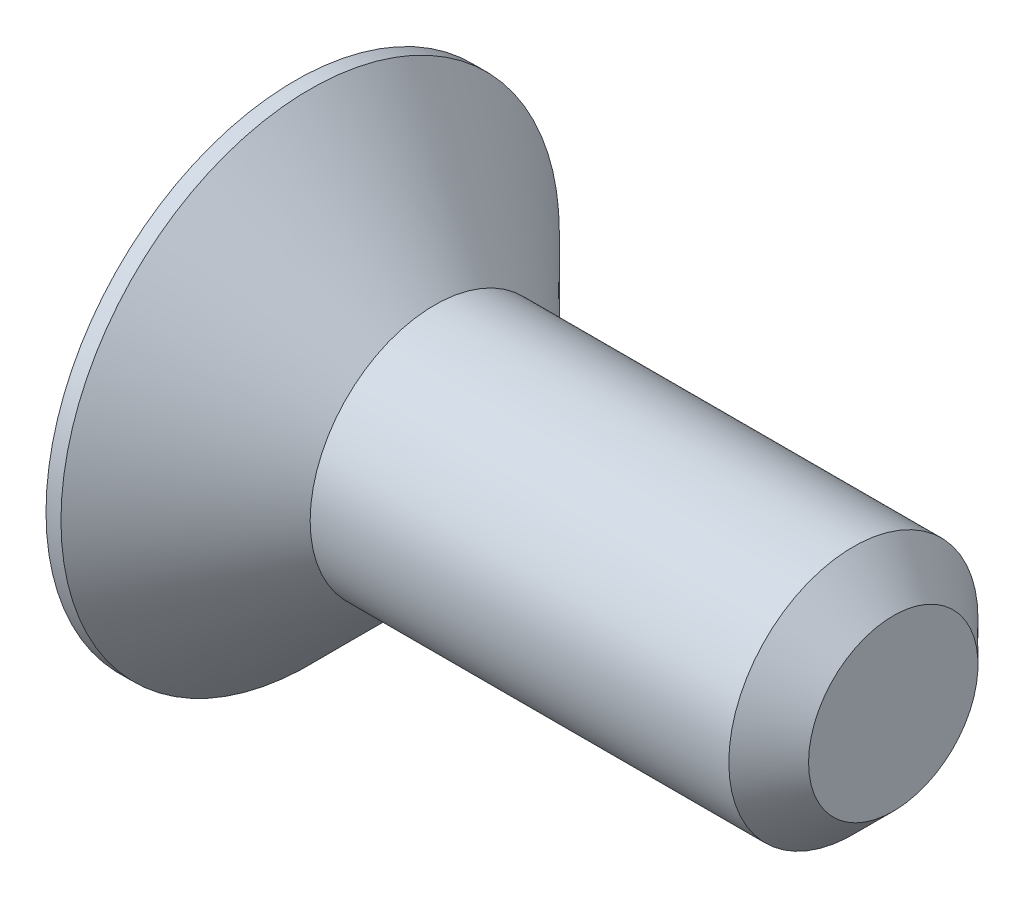
ISO-10303-21;
HEADER;
FILE_DESCRIPTION(('STEP AP214'),'2;1');
FILE_NAME('part.step','',(''),(''),'','','');
FILE_SCHEMA(('AUTOMOTIVE_DESIGN { 1 0 10303 214 1 1 1 1 }'));
ENDSEC;
DATA;
#1=APPLICATION_CONTEXT('core data for automotive mechanical design processes');
#2=APPLICATION_PROTOCOL_DEFINITION('international standard','automotive_design',2000,#1);
#3=PRODUCT_CONTEXT('',#1,'mechanical');
#4=PRODUCT('Part','Part','',(#3));
#5=PRODUCT_RELATED_PRODUCT_CATEGORY('part','',(#4));
#6=PRODUCT_DEFINITION_FORMATION('','',#4);
#7=PRODUCT_DEFINITION_CONTEXT('part definition',#1,'design');
#8=PRODUCT_DEFINITION('design','',#6,#7);
#9=PRODUCT_DEFINITION_SHAPE('','',#8);
#10=(LENGTH_UNIT() NAMED_UNIT(*) SI_UNIT(.MILLI.,.METRE.));
#11=(NAMED_UNIT(*) PLANE_ANGLE_UNIT() SI_UNIT($,.RADIAN.));
#12=(NAMED_UNIT(*) SI_UNIT($,.STERADIAN.) SOLID_ANGLE_UNIT());
#13=UNCERTAINTY_MEASURE_WITH_UNIT(LENGTH_MEASURE(1.E-05),#10,'distance_accuracy_value','');
#14=(GEOMETRIC_REPRESENTATION_CONTEXT(3) GLOBAL_UNCERTAINTY_ASSIGNED_CONTEXT((#13)) GLOBAL_UNIT_ASSIGNED_CONTEXT((#10,
#11,#12)) REPRESENTATION_CONTEXT('',''));
#15=CARTESIAN_POINT('',(0.,0.,0.));
#16=DIRECTION('',(0.,0.,1.));
#17=DIRECTION('',(1.,0.,0.));
#18=AXIS2_PLACEMENT_3D('',#15,#16,#17);
#19=CARTESIAN_POINT('',(-2.8,-5.,0.));
#20=DIRECTION('',(-1.,0.,0.));
#21=DIRECTION('',(0.,0.,1.));
#22=AXIS2_PLACEMENT_3D('',#19,#20,#21);
#23=PLANE('',#22);
#24=DIRECTION('',(0.,0.5,-0.866025403784439));
#25=VECTOR('',#24,1.);
#26=CARTESIAN_POINT('',(-2.8,0.866025403784439,1.5));
#27=LINE('',#26,#25);
#28=CARTESIAN_POINT('',(-2.8,0.866025403784439,1.5));
#29=VERTEX_POINT('',#28);
#30=CARTESIAN_POINT('',(-2.8,1.73205080756888,0.));
#31=VERTEX_POINT('',#30);
#32=EDGE_CURVE('E54',#29,#31,#27,.T.);
#33=ORIENTED_EDGE('',*,*,#32,.F.);
#34=DIRECTION('',(0.,1.,0.));
#35=VECTOR('',#34,1.);
#36=CARTESIAN_POINT('',(-2.8,-0.86602540378444,1.5));
#37=LINE('',#36,#35);
#38=CARTESIAN_POINT('',(-2.8,-0.86602540378444,1.5));
#39=VERTEX_POINT('',#38);
#40=EDGE_CURVE('E137',#39,#29,#37,.T.);
#41=ORIENTED_EDGE('',*,*,#40,.F.);
#42=DIRECTION('',(0.,0.5,0.866025403784439));
#43=VECTOR('',#42,1.);
#44=CARTESIAN_POINT('',(-2.8,-1.73205080756888,0.));
#45=LINE('',#44,#43);
#46=CARTESIAN_POINT('',(-2.8,-1.73205080756888,0.));
#47=VERTEX_POINT('',#46);
#48=EDGE_CURVE('E135',#47,#39,#45,.T.);
#49=ORIENTED_EDGE('',*,*,#48,.F.);
#50=DIRECTION('',(0.,-0.5,0.866025403784439));
#51=VECTOR('',#50,1.);
#52=CARTESIAN_POINT('',(-2.8,-0.86602540378444,-1.5));
#53=LINE('',#52,#51);
#54=CARTESIAN_POINT('',(-2.8,-0.86602540378444,-1.5));
#55=VERTEX_POINT('',#54);
#56=EDGE_CURVE('E102',#55,#47,#53,.T.);
#57=ORIENTED_EDGE('',*,*,#56,.F.);
#58=DIRECTION('',(0.,-1.,0.));
#59=VECTOR('',#58,1.);
#60=CARTESIAN_POINT('',(-2.8,0.866025403784439,-1.5));
#61=LINE('',#60,#59);
#62=CARTESIAN_POINT('',(-2.8,0.866025403784439,-1.5));
#63=VERTEX_POINT('',#62);
#64=EDGE_CURVE('E131',#63,#55,#61,.T.);
#65=ORIENTED_EDGE('',*,*,#64,.F.);
#66=DIRECTION('',(0.,-0.5,-0.866025403784439));
#67=VECTOR('',#66,1.);
#68=CARTESIAN_POINT('',(-2.8,1.73205080756888,0.));
#69=LINE('',#68,#67);
#70=EDGE_CURVE('E128',#31,#63,#69,.T.);
#71=ORIENTED_EDGE('',*,*,#70,.F.);
#72=EDGE_LOOP('',(#33,#41,#49,#57,#65,#71));
#73=FACE_BOUND('',#72,.T.);
#74=CARTESIAN_POINT('',(-2.8,0.,0.));
#75=DIRECTION('',(-1.,0.,0.));
#76=DIRECTION('',(0.,0.,1.));
#77=AXIS2_PLACEMENT_3D('',#74,#75,#76);
#78=CIRCLE('',#77,5.);
#79=CARTESIAN_POINT('',(-2.8,0.,5.));
#80=VERTEX_POINT('',#79);
#81=EDGE_CURVE('E11',#80,#80,#78,.T.);
#82=ORIENTED_EDGE('',*,*,#81,.T.);
#83=EDGE_LOOP('',(#82));
#84=FACE_BOUND('',#83,.T.);
#85=ADVANCED_FACE('F40',(#73,#84),#23,.T.);
#86=CARTESIAN_POINT('',(-2.8,0.,0.));
#87=DIRECTION('',(-1.,0.,0.));
#88=DIRECTION('',(0.,0.,1.));
#89=AXIS2_PLACEMENT_3D('',#86,#87,#88);
#90=CYLINDRICAL_SURFACE('',#89,5.);
#91=CARTESIAN_POINT('',(-2.49999999999999,0.,0.));
#92=DIRECTION('',(-1.,0.,0.));
#93=DIRECTION('',(0.,0.,1.));
#94=AXIS2_PLACEMENT_3D('',#91,#92,#93);
#95=CIRCLE('',#94,5.);
#96=CARTESIAN_POINT('',(-2.49999999999999,0.,5.));
#97=VERTEX_POINT('',#96);
#98=EDGE_CURVE('E47',#97,#97,#95,.T.);
#99=ORIENTED_EDGE('',*,*,#98,.T.);
#100=EDGE_LOOP('',(#99));
#101=FACE_BOUND('',#100,.T.);
#102=ORIENTED_EDGE('',*,*,#81,.F.);
#103=EDGE_LOOP('',(#102));
#104=FACE_BOUND('',#103,.T.);
#105=ADVANCED_FACE('F157',(#101,#104),#90,.T.);
#106=CARTESIAN_POINT('',(-2.49999999999999,0.,0.));
#107=DIRECTION('',(-1.,0.,0.));
#108=DIRECTION('',(0.,0.,1.));
#109=AXIS2_PLACEMENT_3D('',#106,#107,#108);
#110=CONICAL_SURFACE('',#109,5.,0.78539816339745);
#111=CARTESIAN_POINT('',(0.,0.,0.));
#112=DIRECTION('',(-1.,0.,0.));
#113=DIRECTION('',(0.,0.,1.));
#114=AXIS2_PLACEMENT_3D('',#111,#112,#113);
#115=CIRCLE('',#114,2.5);
#116=CARTESIAN_POINT('',(0.,0.,2.5));
#117=VERTEX_POINT('',#116);
#118=EDGE_CURVE('E152',#117,#117,#115,.T.);
#119=ORIENTED_EDGE('',*,*,#118,.T.);
#120=EDGE_LOOP('',(#119));
#121=FACE_BOUND('',#120,.T.);
#122=ORIENTED_EDGE('',*,*,#98,.F.);
#123=EDGE_LOOP('',(#122));
#124=FACE_BOUND('',#123,.T.);
#125=ADVANCED_FACE('F160',(#121,#124),#110,.T.);
#126=CARTESIAN_POINT('',(-2.8,0.,0.));
#127=DIRECTION('',(-1.,0.,0.));
#128=DIRECTION('',(0.,0.,1.));
#129=AXIS2_PLACEMENT_3D('',#126,#127,#128);
#130=CYLINDRICAL_SURFACE('',#129,2.5);
#131=CARTESIAN_POINT('',(8.4,0.,0.));
#132=DIRECTION('',(-1.,0.,0.));
#133=DIRECTION('',(0.,0.,1.));
#134=AXIS2_PLACEMENT_3D('',#131,#132,#133);
#135=CIRCLE('',#134,2.5);
#136=CARTESIAN_POINT('',(8.4,0.,2.5));
#137=VERTEX_POINT('',#136);
#138=EDGE_CURVE('E149',#137,#137,#135,.T.);
#139=ORIENTED_EDGE('',*,*,#138,.T.);
#140=EDGE_LOOP('',(#139));
#141=FACE_BOUND('',#140,.T.);
#142=ORIENTED_EDGE('',*,*,#118,.F.);
#143=EDGE_LOOP('',(#142));
#144=FACE_BOUND('',#143,.T.);
#145=ADVANCED_FACE('F162',(#141,#144),#130,.T.);
#146=CARTESIAN_POINT('',(8.4,0.,0.));
#147=DIRECTION('',(-1.,0.,0.));
#148=DIRECTION('',(0.,0.,1.));
#149=AXIS2_PLACEMENT_3D('',#146,#147,#148);
#150=CONICAL_SURFACE('',#149,2.5,0.785398163397447);
#151=CARTESIAN_POINT('',(9.2,0.,0.));
#152=DIRECTION('',(-1.,0.,0.));
#153=DIRECTION('',(0.,0.,1.));
#154=AXIS2_PLACEMENT_3D('',#151,#152,#153);
#155=CIRCLE('',#154,1.7);
#156=CARTESIAN_POINT('',(9.2,0.,1.7));
#157=VERTEX_POINT('',#156);
#158=EDGE_CURVE('E141',#157,#157,#155,.T.);
#159=ORIENTED_EDGE('',*,*,#158,.T.);
#160=EDGE_LOOP('',(#159));
#161=FACE_BOUND('',#160,.T.);
#162=ORIENTED_EDGE('',*,*,#138,.F.);
#163=EDGE_LOOP('',(#162));
#164=FACE_BOUND('',#163,.T.);
#165=ADVANCED_FACE('F169',(#161,#164),#150,.T.);
#166=CARTESIAN_POINT('',(9.2,-1.7,0.));
#167=DIRECTION('',(1.,0.,0.));
#168=DIRECTION('',(0.,0.,-1.));
#169=AXIS2_PLACEMENT_3D('',#166,#167,#168);
#170=PLANE('',#169);
#171=ORIENTED_EDGE('',*,*,#158,.F.);
#172=EDGE_LOOP('',(#171));
#173=FACE_BOUND('',#172,.T.);
#174=ADVANCED_FACE('F187',(#173),#170,.T.);
#175=CARTESIAN_POINT('',(-0.9,0.866025403784439,1.5));
#176=DIRECTION('',(0.,0.866025403784439,0.5));
#177=DIRECTION('',(0.,-0.5,0.866025403784439));
#178=AXIS2_PLACEMENT_3D('',#175,#176,#177);
#179=PLANE('',#178);
#180=ORIENTED_EDGE('',*,*,#32,.T.);
#181=DIRECTION('',(-1.,0.,0.));
#182=VECTOR('',#181,1.);
#183=CARTESIAN_POINT('',(-0.9,1.73205080756888,0.));
#184=LINE('',#183,#182);
#185=CARTESIAN_POINT('',(-0.9,1.73205080756888,0.));
#186=VERTEX_POINT('',#185);
#187=EDGE_CURVE('E84',#186,#31,#184,.T.);
#188=ORIENTED_EDGE('',*,*,#187,.F.);
#189=DIRECTION('',(0.,0.5,-0.866025403784439));
#190=VECTOR('',#189,1.);
#191=CARTESIAN_POINT('',(-0.9,0.866025403784439,1.5));
#192=LINE('',#191,#190);
#193=CARTESIAN_POINT('',(-0.9,0.866025403784439,1.5));
#194=VERTEX_POINT('',#193);
#195=EDGE_CURVE('E139',#194,#186,#192,.T.);
#196=ORIENTED_EDGE('',*,*,#195,.F.);
#197=DIRECTION('',(-1.,0.,0.));
#198=VECTOR('',#197,1.);
#199=CARTESIAN_POINT('',(-0.9,0.866025403784439,1.5));
#200=LINE('',#199,#198);
#201=EDGE_CURVE('E62',#194,#29,#200,.T.);
#202=ORIENTED_EDGE('',*,*,#201,.T.);
#203=EDGE_LOOP('',(#180,#188,#196,#202));
#204=FACE_BOUND('',#203,.T.);
#205=ADVANCED_FACE('F184',(#204),#179,.F.);
#206=CARTESIAN_POINT('',(-0.9,-0.86602540378444,1.5));
#207=DIRECTION('',(0.,0.,1.));
#208=DIRECTION('',(0.,-1.,0.));
#209=AXIS2_PLACEMENT_3D('',#206,#207,#208);
#210=PLANE('',#209);
#211=ORIENTED_EDGE('',*,*,#40,.T.);
#212=ORIENTED_EDGE('',*,*,#201,.F.);
#213=DIRECTION('',(0.,1.,0.));
#214=VECTOR('',#213,1.);
#215=CARTESIAN_POINT('',(-0.9,-0.86602540378444,1.5));
#216=LINE('',#215,#214);
#217=CARTESIAN_POINT('',(-0.9,-0.86602540378444,1.5));
#218=VERTEX_POINT('',#217);
#219=EDGE_CURVE('E114',#218,#194,#216,.T.);
#220=ORIENTED_EDGE('',*,*,#219,.F.);
#221=DIRECTION('',(-1.,0.,0.));
#222=VECTOR('',#221,1.);
#223=CARTESIAN_POINT('',(-0.9,-0.86602540378444,1.5));
#224=LINE('',#223,#222);
#225=EDGE_CURVE('E106',#218,#39,#224,.T.);
#226=ORIENTED_EDGE('',*,*,#225,.T.);
#227=EDGE_LOOP('',(#211,#212,#220,#226));
#228=FACE_BOUND('',#227,.T.);
#229=ADVANCED_FACE('F186',(#228),#210,.F.);
#230=CARTESIAN_POINT('',(-0.9,-1.73205080756888,0.));
#231=DIRECTION('',(0.,-0.866025403784439,0.5));
#232=DIRECTION('',(0.,-0.5,-0.866025403784439));
#233=AXIS2_PLACEMENT_3D('',#230,#231,#232);
#234=PLANE('',#233);
#235=ORIENTED_EDGE('',*,*,#48,.T.);
#236=ORIENTED_EDGE('',*,*,#225,.F.);
#237=DIRECTION('',(0.,0.5,0.866025403784439));
#238=VECTOR('',#237,1.);
#239=CARTESIAN_POINT('',(-0.9,-1.73205080756888,0.));
#240=LINE('',#239,#238);
#241=CARTESIAN_POINT('',(-0.9,-1.73205080756888,0.));
#242=VERTEX_POINT('',#241);
#243=EDGE_CURVE('E110',#242,#218,#240,.T.);
#244=ORIENTED_EDGE('',*,*,#243,.F.);
#245=DIRECTION('',(-1.,0.,0.));
#246=VECTOR('',#245,1.);
#247=CARTESIAN_POINT('',(-0.9,-1.73205080756888,0.));
#248=LINE('',#247,#246);
#249=EDGE_CURVE('E95',#242,#47,#248,.T.);
#250=ORIENTED_EDGE('',*,*,#249,.T.);
#251=EDGE_LOOP('',(#235,#236,#244,#250));
#252=FACE_BOUND('',#251,.T.);
#253=ADVANCED_FACE('F111',(#252),#234,.F.);
#254=CARTESIAN_POINT('',(-0.9,-0.86602540378444,-1.5));
#255=DIRECTION('',(0.,-0.866025403784438,-0.5));
#256=DIRECTION('',(0.,0.5,-0.866025403784439));
#257=AXIS2_PLACEMENT_3D('',#254,#255,#256);
#258=PLANE('',#257);
#259=ORIENTED_EDGE('',*,*,#56,.T.);
#260=ORIENTED_EDGE('',*,*,#249,.F.);
#261=DIRECTION('',(0.,-0.5,0.866025403784439));
#262=VECTOR('',#261,1.);
#263=CARTESIAN_POINT('',(-0.9,-0.86602540378444,-1.5));
#264=LINE('',#263,#262);
#265=CARTESIAN_POINT('',(-0.9,-0.86602540378444,-1.5));
#266=VERTEX_POINT('',#265);
#267=EDGE_CURVE('E99',#266,#242,#264,.T.);
#268=ORIENTED_EDGE('',*,*,#267,.F.);
#269=DIRECTION('',(-1.,0.,0.));
#270=VECTOR('',#269,1.);
#271=CARTESIAN_POINT('',(-0.9,-0.86602540378444,-1.5));
#272=LINE('',#271,#270);
#273=EDGE_CURVE('E107',#266,#55,#272,.T.);
#274=ORIENTED_EDGE('',*,*,#273,.T.);
#275=EDGE_LOOP('',(#259,#260,#268,#274));
#276=FACE_BOUND('',#275,.T.);
#277=ADVANCED_FACE('F97',(#276),#258,.F.);
#278=CARTESIAN_POINT('',(-0.9,0.866025403784439,-1.5));
#279=DIRECTION('',(0.,0.,-1.));
#280=DIRECTION('',(-1.,0.,0.));
#281=AXIS2_PLACEMENT_3D('',#278,#279,#280);
#282=PLANE('',#281);
#283=ORIENTED_EDGE('',*,*,#64,.T.);
#284=ORIENTED_EDGE('',*,*,#273,.F.);
#285=DIRECTION('',(0.,-1.,0.));
#286=VECTOR('',#285,1.);
#287=CARTESIAN_POINT('',(-0.9,0.866025403784439,-1.5));
#288=LINE('',#287,#286);
#289=CARTESIAN_POINT('',(-0.9,0.866025403784439,-1.5));
#290=VERTEX_POINT('',#289);
#291=EDGE_CURVE('E120',#290,#266,#288,.T.);
#292=ORIENTED_EDGE('',*,*,#291,.F.);
#293=DIRECTION('',(-1.,0.,0.));
#294=VECTOR('',#293,1.);
#295=CARTESIAN_POINT('',(-0.9,0.866025403784439,-1.5));
#296=LINE('',#295,#294);
#297=EDGE_CURVE('E144',#290,#63,#296,.T.);
#298=ORIENTED_EDGE('',*,*,#297,.T.);
#299=EDGE_LOOP('',(#283,#284,#292,#298));
#300=FACE_BOUND('',#299,.T.);
#301=ADVANCED_FACE('F252',(#300),#282,.F.);
#302=CARTESIAN_POINT('',(-0.9,1.73205080756888,0.));
#303=DIRECTION('',(0.,0.866025403784439,-0.5));
#304=DIRECTION('',(0.,0.5,0.866025403784439));
#305=AXIS2_PLACEMENT_3D('',#302,#303,#304);
#306=PLANE('',#305);
#307=ORIENTED_EDGE('',*,*,#70,.T.);
#308=ORIENTED_EDGE('',*,*,#297,.F.);
#309=DIRECTION('',(0.,-0.5,-0.866025403784439));
#310=VECTOR('',#309,1.);
#311=CARTESIAN_POINT('',(-0.9,1.73205080756888,0.));
#312=LINE('',#311,#310);
#313=EDGE_CURVE('E122',#186,#290,#312,.T.);
#314=ORIENTED_EDGE('',*,*,#313,.F.);
#315=ORIENTED_EDGE('',*,*,#187,.T.);
#316=EDGE_LOOP('',(#307,#308,#314,#315));
#317=FACE_BOUND('',#316,.T.);
#318=ADVANCED_FACE('F182',(#317),#306,.F.);
#319=CARTESIAN_POINT('',(-0.9,0.,0.));
#320=DIRECTION('',(-1.,0.,0.));
#321=DIRECTION('',(0.,0.,1.));
#322=AXIS2_PLACEMENT_3D('',#319,#320,#321);
#323=PLANE('',#322);
#324=ORIENTED_EDGE('',*,*,#195,.T.);
#325=ORIENTED_EDGE('',*,*,#313,.T.);
#326=ORIENTED_EDGE('',*,*,#291,.T.);
#327=ORIENTED_EDGE('',*,*,#267,.T.);
#328=ORIENTED_EDGE('',*,*,#243,.T.);
#329=ORIENTED_EDGE('',*,*,#219,.T.);
#330=EDGE_LOOP('',(#324,#325,#326,#327,#328,#329));
#331=FACE_BOUND('',#330,.T.);
#332=ADVANCED_FACE('F117',(#331),#323,.T.);
#333=CLOSED_SHELL('',(#85,#105,#125,#145,#165,#174,#205,#229,#253,#277,#301,#318,#332));
#334=MANIFOLD_SOLID_BREP('B2',#333);
#335=ADVANCED_BREP_SHAPE_REPRESENTATION('',(#18,#334),#14);
#336=SHAPE_DEFINITION_REPRESENTATION(#9,#335);
ENDSEC;
END-ISO-10303-21;
